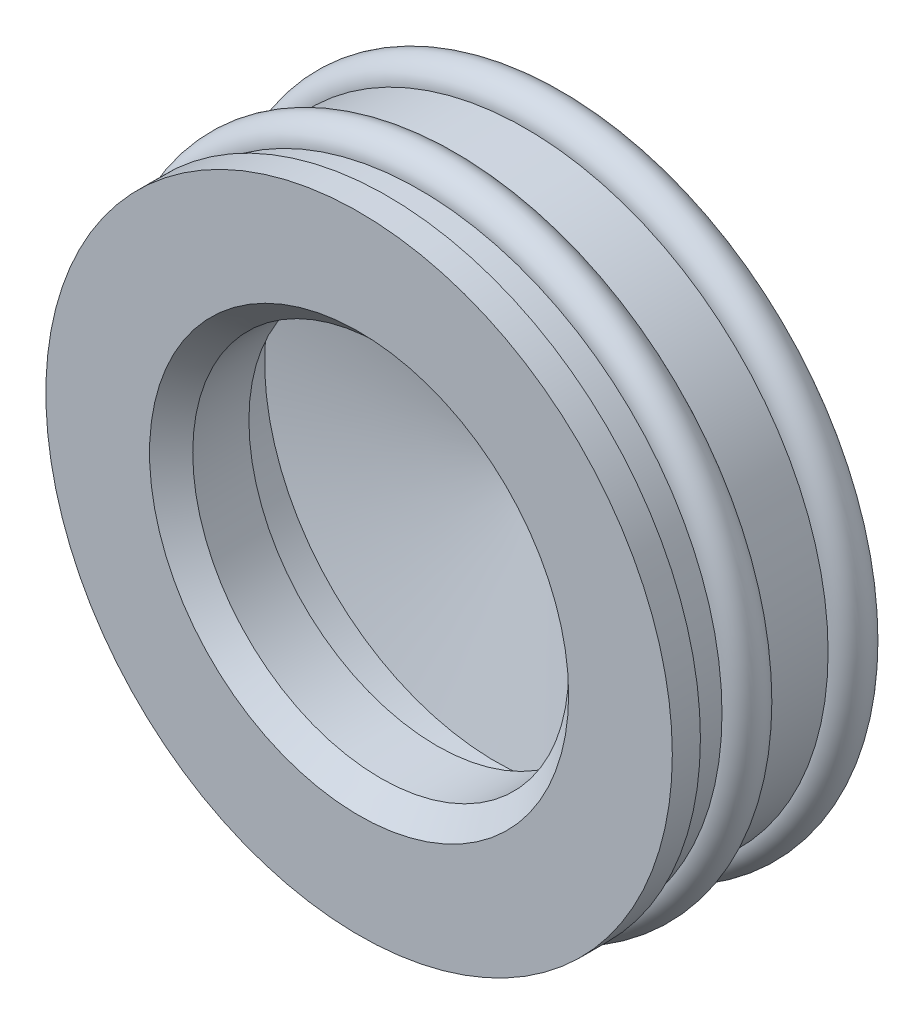
ISO-10303-21;
HEADER;
FILE_DESCRIPTION(('STEP AP214'),'2;1');
FILE_NAME('part.step','',(''),(''),'','','');
FILE_SCHEMA(('AUTOMOTIVE_DESIGN { 1 0 10303 214 1 1 1 1 }'));
ENDSEC;
DATA;
#1=APPLICATION_CONTEXT('core data for automotive mechanical design processes');
#2=APPLICATION_PROTOCOL_DEFINITION('international standard','automotive_design',2000,#1);
#3=PRODUCT_CONTEXT('',#1,'mechanical');
#4=PRODUCT('Part','Part','',(#3));
#5=PRODUCT_RELATED_PRODUCT_CATEGORY('part','',(#4));
#6=PRODUCT_DEFINITION_FORMATION('','',#4);
#7=PRODUCT_DEFINITION_CONTEXT('part definition',#1,'design');
#8=PRODUCT_DEFINITION('design','',#6,#7);
#9=PRODUCT_DEFINITION_SHAPE('','',#8);
#10=(LENGTH_UNIT() NAMED_UNIT(*) SI_UNIT(.MILLI.,.METRE.));
#11=(NAMED_UNIT(*) PLANE_ANGLE_UNIT() SI_UNIT($,.RADIAN.));
#12=(NAMED_UNIT(*) SI_UNIT($,.STERADIAN.) SOLID_ANGLE_UNIT());
#13=UNCERTAINTY_MEASURE_WITH_UNIT(LENGTH_MEASURE(1.E-05),#10,'distance_accuracy_value','');
#14=(GEOMETRIC_REPRESENTATION_CONTEXT(3) GLOBAL_UNCERTAINTY_ASSIGNED_CONTEXT((#13)) GLOBAL_UNIT_ASSIGNED_CONTEXT((#10,
#11,#12)) REPRESENTATION_CONTEXT('',''));
#15=CARTESIAN_POINT('',(0.,0.,0.));
#16=DIRECTION('',(0.,0.,1.));
#17=DIRECTION('',(1.,0.,0.));
#18=AXIS2_PLACEMENT_3D('',#15,#16,#17);
#19=CARTESIAN_POINT('',(0.,0.,-5.80237444145939));
#20=DIRECTION('',(0.,0.,1.));
#21=DIRECTION('',(1.,0.,0.));
#22=AXIS2_PLACEMENT_3D('',#19,#20,#21);
#23=SPHERICAL_SURFACE('',#22,7.);
#24=CARTESIAN_POINT('',(0.,0.,-12.6101750975879));
#25=DIRECTION('',(0.,0.,1.));
#26=DIRECTION('',(1.,0.,0.));
#27=AXIS2_PLACEMENT_3D('',#24,#25,#26);
#28=CIRCLE('',#27,1.6290642180149);
#29=CARTESIAN_POINT('',(1.6290642180149,0.,-12.6101750975879));
#30=VERTEX_POINT('',#29);
#31=EDGE_CURVE('E77',#30,#30,#28,.T.);
#32=ORIENTED_EDGE('',*,*,#31,.F.);
#33=EDGE_LOOP('',(#32));
#34=FACE_BOUND('',#33,.T.);
#35=ADVANCED_FACE('F31',(#34),#23,.T.);
#36=CARTESIAN_POINT('',(0.,0.,-5.80237444145939));
#37=DIRECTION('',(0.,0.,1.));
#38=DIRECTION('',(1.,0.,0.));
#39=AXIS2_PLACEMENT_3D('',#36,#37,#38);
#40=SPHERICAL_SURFACE('',#39,3.);
#41=CARTESIAN_POINT('',(0.,0.,-8.72000329408589));
#42=DIRECTION('',(0.,0.,1.));
#43=DIRECTION('',(1.,0.,0.));
#44=AXIS2_PLACEMENT_3D('',#41,#42,#43);
#45=CIRCLE('',#44,0.698170379149235);
#46=CARTESIAN_POINT('',(0.698170379149235,0.,-8.72000329408589));
#47=VERTEX_POINT('',#46);
#48=EDGE_CURVE('E10',#47,#47,#45,.T.);
#49=ORIENTED_EDGE('',*,*,#48,.T.);
#50=EDGE_LOOP('',(#49));
#51=FACE_BOUND('',#50,.T.);
#52=ADVANCED_FACE('F85',(#51),#40,.F.);
#53=CARTESIAN_POINT('',(0.,0.,-8.72000329408589));
#54=DIRECTION('',(0.,0.,1.));
#55=DIRECTION('',(1.,0.,0.));
#56=AXIS2_PLACEMENT_3D('',#53,#54,#55);
#57=CONICAL_SURFACE('',#56,0.698170379149235,1.33591922887735);
#58=CARTESIAN_POINT('',(0.,0.,-6.32662787476577));
#59=DIRECTION('',(0.,0.,1.));
#60=DIRECTION('',(1.,0.,0.));
#61=AXIS2_PLACEMENT_3D('',#58,#59,#60);
#62=CIRCLE('',#61,10.7);
#63=CARTESIAN_POINT('',(10.7,0.,-6.32662787476577));
#64=VERTEX_POINT('',#63);
#65=EDGE_CURVE('E37',#64,#64,#62,.T.);
#66=ORIENTED_EDGE('',*,*,#65,.T.);
#67=EDGE_LOOP('',(#66));
#68=FACE_BOUND('',#67,.T.);
#69=ORIENTED_EDGE('',*,*,#48,.F.);
#70=EDGE_LOOP('',(#69));
#71=FACE_BOUND('',#70,.T.);
#72=ADVANCED_FACE('F89',(#68,#71),#57,.F.);
#73=CARTESIAN_POINT('',(0.,0.,-12.8023744414594));
#74=DIRECTION('',(0.,0.,1.));
#75=DIRECTION('',(1.,0.,0.));
#76=AXIS2_PLACEMENT_3D('',#73,#74,#75);
#77=CYLINDRICAL_SURFACE('',#76,10.7);
#78=CARTESIAN_POINT('',(0.,0.,-3.6));
#79=DIRECTION('',(0.,0.,1.));
#80=DIRECTION('',(1.,0.,0.));
#81=AXIS2_PLACEMENT_3D('',#78,#79,#80);
#82=CIRCLE('',#81,10.7);
#83=CARTESIAN_POINT('',(10.7,0.,-3.6));
#84=VERTEX_POINT('',#83);
#85=EDGE_CURVE('E41',#84,#84,#82,.T.);
#86=ORIENTED_EDGE('',*,*,#85,.T.);
#87=EDGE_LOOP('',(#86));
#88=FACE_BOUND('',#87,.T.);
#89=ORIENTED_EDGE('',*,*,#65,.F.);
#90=EDGE_LOOP('',(#89));
#91=FACE_BOUND('',#90,.T.);
#92=ADVANCED_FACE('F93',(#88,#91),#77,.F.);
#93=CARTESIAN_POINT('',(10.7,0.,-3.6));
#94=DIRECTION('',(0.,0.,-1.));
#95=DIRECTION('',(-1.,0.,0.));
#96=AXIS2_PLACEMENT_3D('',#93,#94,#95);
#97=PLANE('',#96);
#98=CARTESIAN_POINT('',(0.,0.,-3.6));
#99=DIRECTION('',(0.,0.,1.));
#100=DIRECTION('',(1.,0.,0.));
#101=AXIS2_PLACEMENT_3D('',#98,#99,#100);
#102=CIRCLE('',#101,8.7);
#103=CARTESIAN_POINT('',(8.7,0.,-3.6));
#104=VERTEX_POINT('',#103);
#105=EDGE_CURVE('E45',#104,#104,#102,.T.);
#106=ORIENTED_EDGE('',*,*,#105,.T.);
#107=EDGE_LOOP('',(#106));
#108=FACE_BOUND('',#107,.T.);
#109=ORIENTED_EDGE('',*,*,#85,.F.);
#110=EDGE_LOOP('',(#109));
#111=FACE_BOUND('',#110,.T.);
#112=ADVANCED_FACE('F98',(#108,#111),#97,.T.);
#113=CARTESIAN_POINT('',(0.,0.,-12.8023744414594));
#114=DIRECTION('',(0.,0.,1.));
#115=DIRECTION('',(1.,0.,0.));
#116=AXIS2_PLACEMENT_3D('',#113,#114,#115);
#117=CYLINDRICAL_SURFACE('',#116,8.7);
#118=CARTESIAN_POINT('',(0.,0.,-1.));
#119=DIRECTION('',(0.,0.,1.));
#120=DIRECTION('',(1.,0.,0.));
#121=AXIS2_PLACEMENT_3D('',#118,#119,#120);
#122=CIRCLE('',#121,8.7);
#123=CARTESIAN_POINT('',(8.7,0.,-1.));
#124=VERTEX_POINT('',#123);
#125=EDGE_CURVE('E50',#124,#124,#122,.T.);
#126=ORIENTED_EDGE('',*,*,#125,.T.);
#127=EDGE_LOOP('',(#126));
#128=FACE_BOUND('',#127,.T.);
#129=ORIENTED_EDGE('',*,*,#105,.F.);
#130=EDGE_LOOP('',(#129));
#131=FACE_BOUND('',#130,.T.);
#132=ADVANCED_FACE('F102',(#128,#131),#117,.F.);
#133=CARTESIAN_POINT('',(0.,0.,-1.));
#134=DIRECTION('',(0.,0.,1.));
#135=DIRECTION('',(1.,0.,0.));
#136=AXIS2_PLACEMENT_3D('',#133,#134,#135);
#137=CONICAL_SURFACE('',#136,8.7,0.785398163397446);
#138=CARTESIAN_POINT('',(0.,0.,0.));
#139=DIRECTION('',(0.,0.,1.));
#140=DIRECTION('',(1.,0.,0.));
#141=AXIS2_PLACEMENT_3D('',#138,#139,#140);
#142=CIRCLE('',#141,9.7);
#143=CARTESIAN_POINT('',(9.7,0.,0.));
#144=VERTEX_POINT('',#143);
#145=EDGE_CURVE('E53',#144,#144,#142,.T.);
#146=ORIENTED_EDGE('',*,*,#145,.T.);
#147=EDGE_LOOP('',(#146));
#148=FACE_BOUND('',#147,.T.);
#149=ORIENTED_EDGE('',*,*,#125,.F.);
#150=EDGE_LOOP('',(#149));
#151=FACE_BOUND('',#150,.T.);
#152=ADVANCED_FACE('F106',(#148,#151),#137,.F.);
#153=CARTESIAN_POINT('',(9.7,0.,0.));
#154=DIRECTION('',(0.,0.,1.));
#155=DIRECTION('',(1.,0.,0.));
#156=AXIS2_PLACEMENT_3D('',#153,#154,#155);
#157=PLANE('',#156);
#158=CARTESIAN_POINT('',(0.,0.,0.));
#159=DIRECTION('',(0.,0.,1.));
#160=DIRECTION('',(1.,0.,0.));
#161=AXIS2_PLACEMENT_3D('',#158,#159,#160);
#162=CIRCLE('',#161,14.5);
#163=CARTESIAN_POINT('',(14.5,0.,0.));
#164=VERTEX_POINT('',#163);
#165=EDGE_CURVE('E56',#164,#164,#162,.T.);
#166=ORIENTED_EDGE('',*,*,#165,.T.);
#167=EDGE_LOOP('',(#166));
#168=FACE_BOUND('',#167,.T.);
#169=ORIENTED_EDGE('',*,*,#145,.F.);
#170=EDGE_LOOP('',(#169));
#171=FACE_BOUND('',#170,.T.);
#172=ADVANCED_FACE('F110',(#168,#171),#157,.T.);
#173=CARTESIAN_POINT('',(0.,0.,-12.8023744414594));
#174=DIRECTION('',(0.,0.,1.));
#175=DIRECTION('',(1.,0.,0.));
#176=AXIS2_PLACEMENT_3D('',#173,#174,#175);
#177=CYLINDRICAL_SURFACE('',#176,14.5);
#178=CARTESIAN_POINT('',(0.,0.,-1.3000023257201));
#179=DIRECTION('',(0.,0.,1.));
#180=DIRECTION('',(1.,0.,0.));
#181=AXIS2_PLACEMENT_3D('',#178,#179,#180);
#182=CIRCLE('',#181,14.5);
#183=CARTESIAN_POINT('',(14.5,0.,-1.3000023257201));
#184=VERTEX_POINT('',#183);
#185=EDGE_CURVE('E59',#184,#184,#182,.T.);
#186=ORIENTED_EDGE('',*,*,#185,.T.);
#187=EDGE_LOOP('',(#186));
#188=FACE_BOUND('',#187,.T.);
#189=ORIENTED_EDGE('',*,*,#165,.F.);
#190=EDGE_LOOP('',(#189));
#191=FACE_BOUND('',#190,.T.);
#192=ADVANCED_FACE('F114',(#188,#191),#177,.T.);
#193=CARTESIAN_POINT('',(14.5,0.,-1.3000023257201));
#194=DIRECTION('',(0.,0.,-1.));
#195=DIRECTION('',(-1.,0.,0.));
#196=AXIS2_PLACEMENT_3D('',#193,#194,#195);
#197=PLANE('',#196);
#198=CARTESIAN_POINT('',(0.,0.,-1.3000023257201));
#199=DIRECTION('',(0.,0.,1.));
#200=DIRECTION('',(1.,0.,0.));
#201=AXIS2_PLACEMENT_3D('',#198,#199,#200);
#202=CIRCLE('',#201,14.000000007362);
#203=CARTESIAN_POINT('',(14.000000007362,0.,-1.3000023257201));
#204=VERTEX_POINT('',#203);
#205=EDGE_CURVE('E62',#204,#204,#202,.T.);
#206=ORIENTED_EDGE('',*,*,#205,.T.);
#207=EDGE_LOOP('',(#206));
#208=FACE_BOUND('',#207,.T.);
#209=ORIENTED_EDGE('',*,*,#185,.F.);
#210=EDGE_LOOP('',(#209));
#211=FACE_BOUND('',#210,.T.);
#212=ADVANCED_FACE('F118',(#208,#211),#197,.T.);
#213=CARTESIAN_POINT('',(0.,0.,-12.8023744414594));
#214=DIRECTION('',(0.,0.,1.));
#215=DIRECTION('',(1.,0.,0.));
#216=AXIS2_PLACEMENT_3D('',#213,#214,#215);
#217=CYLINDRICAL_SURFACE('',#216,14.000000007362);
#218=CARTESIAN_POINT('',(0.,0.,-2.8000023257201));
#219=DIRECTION('',(0.,0.,1.));
#220=DIRECTION('',(1.,0.,0.));
#221=AXIS2_PLACEMENT_3D('',#218,#219,#220);
#222=CIRCLE('',#221,14.000000007362);
#223=CARTESIAN_POINT('',(14.000000007362,0.,-2.8000023257201));
#224=VERTEX_POINT('',#223);
#225=EDGE_CURVE('E65',#224,#224,#222,.T.);
#226=ORIENTED_EDGE('',*,*,#225,.T.);
#227=EDGE_LOOP('',(#226));
#228=FACE_BOUND('',#227,.T.);
#229=ORIENTED_EDGE('',*,*,#205,.F.);
#230=EDGE_LOOP('',(#229));
#231=FACE_BOUND('',#230,.T.);
#232=ADVANCED_FACE('F122',(#228,#231),#217,.T.);
#233=CARTESIAN_POINT('',(0.,0.,-3.75572981741067));
#234=DIRECTION('',(0.,0.,1.));
#235=DIRECTION('',(1.,0.,0.));
#236=AXIS2_PLACEMENT_3D('',#233,#234,#235);
#237=TOROIDAL_SURFACE('',#236,14.000000007362,0.955727491690574);
#238=CARTESIAN_POINT('',(0.,0.,-4.71145730910124));
#239=DIRECTION('',(0.,0.,1.));
#240=DIRECTION('',(1.,0.,0.));
#241=AXIS2_PLACEMENT_3D('',#238,#239,#240);
#242=CIRCLE('',#241,14.000000007362);
#243=CARTESIAN_POINT('',(14.000000007362,0.,-4.71145730910124));
#244=VERTEX_POINT('',#243);
#245=EDGE_CURVE('E68',#244,#244,#242,.T.);
#246=ORIENTED_EDGE('',*,*,#245,.T.);
#247=EDGE_LOOP('',(#246));
#248=FACE_BOUND('',#247,.T.);
#249=ORIENTED_EDGE('',*,*,#225,.F.);
#250=EDGE_LOOP('',(#249));
#251=FACE_BOUND('',#250,.T.);
#252=ADVANCED_FACE('F126',(#248,#251),#237,.T.);
#253=CARTESIAN_POINT('',(0.,0.,-12.8023744414594));
#254=DIRECTION('',(0.,0.,1.));
#255=DIRECTION('',(1.,0.,0.));
#256=AXIS2_PLACEMENT_3D('',#253,#254,#255);
#257=CYLINDRICAL_SURFACE('',#256,14.000000007362);
#258=CARTESIAN_POINT('',(0.,0.,-7.71145498160699));
#259=DIRECTION('',(0.,0.,1.));
#260=DIRECTION('',(1.,0.,0.));
#261=AXIS2_PLACEMENT_3D('',#258,#259,#260);
#262=CIRCLE('',#261,14.000000007362);
#263=CARTESIAN_POINT('',(14.000000007362,0.,-7.71145498160699));
#264=VERTEX_POINT('',#263);
#265=EDGE_CURVE('E71',#264,#264,#262,.T.);
#266=ORIENTED_EDGE('',*,*,#265,.T.);
#267=EDGE_LOOP('',(#266));
#268=FACE_BOUND('',#267,.T.);
#269=ORIENTED_EDGE('',*,*,#245,.F.);
#270=EDGE_LOOP('',(#269));
#271=FACE_BOUND('',#270,.T.);
#272=ADVANCED_FACE('F130',(#268,#271),#257,.T.);
#273=CARTESIAN_POINT('',(0.,0.,-8.66718247329157));
#274=DIRECTION('',(0.,0.,1.));
#275=DIRECTION('',(1.,0.,0.));
#276=AXIS2_PLACEMENT_3D('',#273,#274,#275);
#277=TOROIDAL_SURFACE('',#276,14.000000007362,0.955727491684582);
#278=CARTESIAN_POINT('',(0.,0.,-9.59595992887394));
#279=DIRECTION('',(0.,0.,1.));
#280=DIRECTION('',(1.,0.,0.));
#281=AXIS2_PLACEMENT_3D('',#278,#279,#280);
#282=CIRCLE('',#281,14.2253607767155);
#283=CARTESIAN_POINT('',(14.2253607767155,0.,-9.59595992887394));
#284=VERTEX_POINT('',#283);
#285=EDGE_CURVE('E74',#284,#284,#282,.T.);
#286=ORIENTED_EDGE('',*,*,#285,.T.);
#287=EDGE_LOOP('',(#286));
#288=FACE_BOUND('',#287,.T.);
#289=ORIENTED_EDGE('',*,*,#265,.F.);
#290=EDGE_LOOP('',(#289));
#291=FACE_BOUND('',#290,.T.);
#292=ADVANCED_FACE('F134',(#288,#291),#277,.T.);
#293=CARTESIAN_POINT('',(0.,0.,-9.59595992887394));
#294=DIRECTION('',(0.,0.,1.));
#295=DIRECTION('',(1.,0.,0.));
#296=AXIS2_PLACEMENT_3D('',#293,#294,#295);
#297=CONICAL_SURFACE('',#296,14.2253607767155,1.33591922887735);
#298=ORIENTED_EDGE('',*,*,#31,.T.);
#299=EDGE_LOOP('',(#298));
#300=FACE_BOUND('',#299,.T.);
#301=ORIENTED_EDGE('',*,*,#285,.F.);
#302=EDGE_LOOP('',(#301));
#303=FACE_BOUND('',#302,.T.);
#304=ADVANCED_FACE('F81',(#300,#303),#297,.T.);
#305=CLOSED_SHELL('',(#35,#52,#72,#92,#112,#132,#152,#172,#192,#212,#232,#252,#272,#292,#304));
#306=MANIFOLD_SOLID_BREP('B2',#305);
#307=ADVANCED_BREP_SHAPE_REPRESENTATION('',(#18,#306),#14);
#308=SHAPE_DEFINITION_REPRESENTATION(#9,#307);
ENDSEC;
END-ISO-10303-21;
